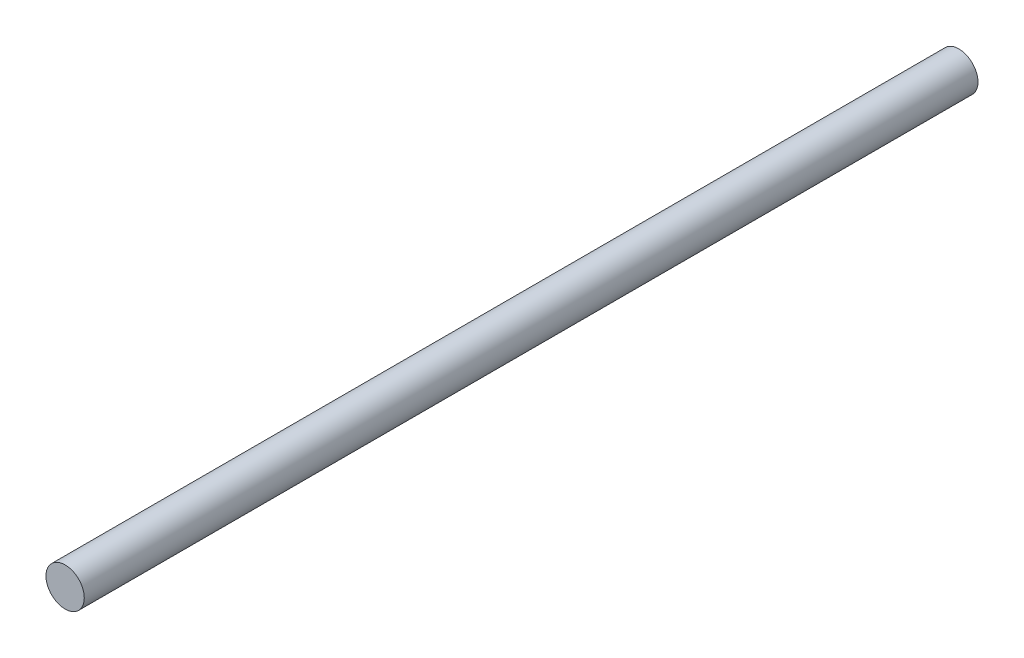
ISO-10303-21;
HEADER;
FILE_DESCRIPTION(('STEP AP214'),'2;1');
FILE_NAME('part.step','',(''),(''),'','','');
FILE_SCHEMA(('AUTOMOTIVE_DESIGN { 1 0 10303 214 1 1 1 1 }'));
ENDSEC;
DATA;
#1=APPLICATION_CONTEXT('core data for automotive mechanical design processes');
#2=APPLICATION_PROTOCOL_DEFINITION('international standard','automotive_design',2000,#1);
#3=PRODUCT_CONTEXT('',#1,'mechanical');
#4=PRODUCT('Part','Part','',(#3));
#5=PRODUCT_RELATED_PRODUCT_CATEGORY('part','',(#4));
#6=PRODUCT_DEFINITION_FORMATION('','',#4);
#7=PRODUCT_DEFINITION_CONTEXT('part definition',#1,'design');
#8=PRODUCT_DEFINITION('design','',#6,#7);
#9=PRODUCT_DEFINITION_SHAPE('','',#8);
#10=(LENGTH_UNIT() NAMED_UNIT(*) SI_UNIT(.MILLI.,.METRE.));
#11=(NAMED_UNIT(*) PLANE_ANGLE_UNIT() SI_UNIT($,.RADIAN.));
#12=(NAMED_UNIT(*) SI_UNIT($,.STERADIAN.) SOLID_ANGLE_UNIT());
#13=UNCERTAINTY_MEASURE_WITH_UNIT(LENGTH_MEASURE(1.E-05),#10,'distance_accuracy_value','');
#14=(GEOMETRIC_REPRESENTATION_CONTEXT(3) GLOBAL_UNCERTAINTY_ASSIGNED_CONTEXT((#13)) GLOBAL_UNIT_ASSIGNED_CONTEXT((#10,
#11,#12)) REPRESENTATION_CONTEXT('',''));
#15=CARTESIAN_POINT('',(0.,0.,0.));
#16=DIRECTION('',(0.,0.,1.));
#17=DIRECTION('',(1.,0.,0.));
#18=AXIS2_PLACEMENT_3D('',#15,#16,#17);
#19=CARTESIAN_POINT('',(-1.25050238489195,4.45883128891128,70.));
#20=DIRECTION('',(0.,0.,-1.));
#21=DIRECTION('',(-1.,0.,0.));
#22=AXIS2_PLACEMENT_3D('',#19,#20,#21);
#23=CYLINDRICAL_SURFACE('',#22,1.5);
#24=CARTESIAN_POINT('',(-1.25050238489195,4.45883128891128,70.));
#25=DIRECTION('',(0.,0.,1.));
#26=DIRECTION('',(1.,0.,0.));
#27=AXIS2_PLACEMENT_3D('',#24,#25,#26);
#28=CIRCLE('',#27,1.5);
#29=CARTESIAN_POINT('',(0.249497615108051,4.45883128891128,70.));
#30=VERTEX_POINT('',#29);
#31=EDGE_CURVE('E10',#30,#30,#28,.T.);
#32=ORIENTED_EDGE('',*,*,#31,.F.);
#33=EDGE_LOOP('',(#32));
#34=FACE_BOUND('',#33,.T.);
#35=CARTESIAN_POINT('',(-1.25050238489195,4.45883128891128,0.));
#36=DIRECTION('',(0.,0.,1.));
#37=DIRECTION('',(1.,0.,0.));
#38=AXIS2_PLACEMENT_3D('',#35,#36,#37);
#39=CIRCLE('',#38,1.5);
#40=CARTESIAN_POINT('',(0.249497615108051,4.45883128891128,0.));
#41=VERTEX_POINT('',#40);
#42=EDGE_CURVE('E44',#41,#41,#39,.T.);
#43=ORIENTED_EDGE('',*,*,#42,.T.);
#44=EDGE_LOOP('',(#43));
#45=FACE_BOUND('',#44,.T.);
#46=ADVANCED_FACE('F41',(#34,#45),#23,.T.);
#47=CARTESIAN_POINT('',(-1.25050238489195,4.45883128891128,70.));
#48=DIRECTION('',(0.,0.,1.));
#49=DIRECTION('',(1.,0.,0.));
#50=AXIS2_PLACEMENT_3D('',#47,#48,#49);
#51=PLANE('',#50);
#52=ORIENTED_EDGE('',*,*,#31,.T.);
#53=EDGE_LOOP('',(#52));
#54=FACE_BOUND('',#53,.T.);
#55=ADVANCED_FACE('F58',(#54),#51,.T.);
#56=CARTESIAN_POINT('',(-1.25050238489195,4.45883128891128,0.));
#57=DIRECTION('',(0.,0.,1.));
#58=DIRECTION('',(1.,0.,0.));
#59=AXIS2_PLACEMENT_3D('',#56,#57,#58);
#60=PLANE('',#59);
#61=ORIENTED_EDGE('',*,*,#42,.F.);
#62=EDGE_LOOP('',(#61));
#63=FACE_BOUND('',#62,.T.);
#64=ADVANCED_FACE('F56',(#63),#60,.F.);
#65=CLOSED_SHELL('',(#46,#55,#64));
#66=MANIFOLD_SOLID_BREP('B2',#65);
#67=ADVANCED_BREP_SHAPE_REPRESENTATION('',(#18,#66),#14);
#68=SHAPE_DEFINITION_REPRESENTATION(#9,#67);
ENDSEC;
END-ISO-10303-21;
